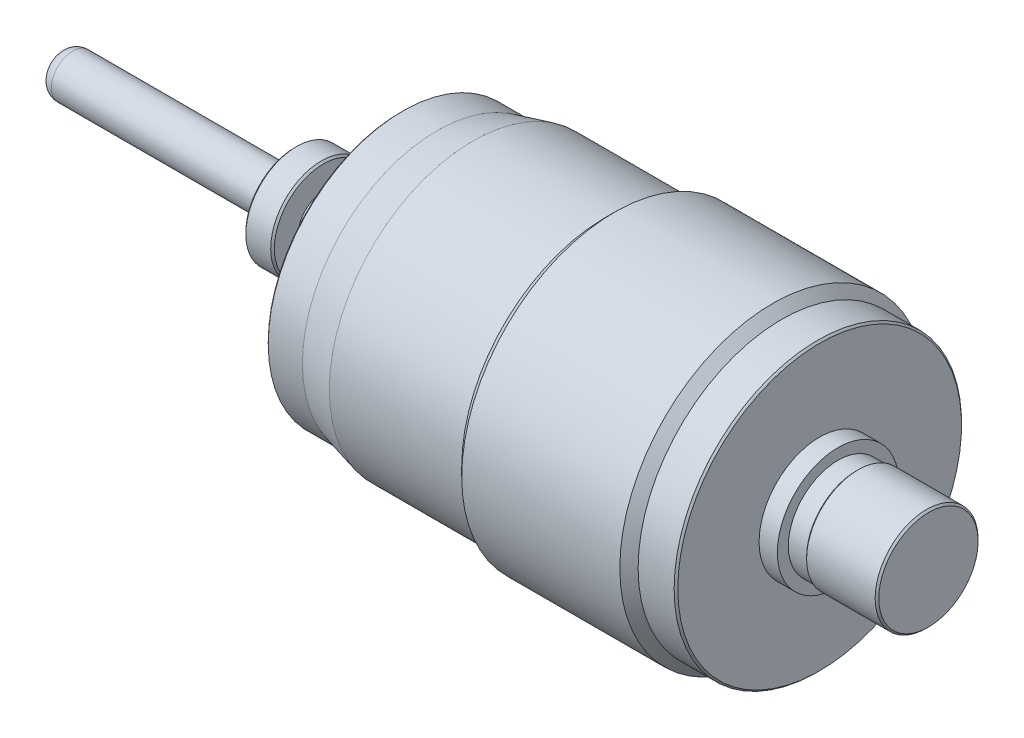
ISO-10303-21;
HEADER;
FILE_DESCRIPTION(('STEP AP214'),'2;1');
FILE_NAME('part.step','',(''),(''),'','','');
FILE_SCHEMA(('AUTOMOTIVE_DESIGN { 1 0 10303 214 1 1 1 1 }'));
ENDSEC;
DATA;
#1=APPLICATION_CONTEXT('core data for automotive mechanical design processes');
#2=APPLICATION_PROTOCOL_DEFINITION('international standard','automotive_design',2000,#1);
#3=PRODUCT_CONTEXT('',#1,'mechanical');
#4=PRODUCT('Part','Part','',(#3));
#5=PRODUCT_RELATED_PRODUCT_CATEGORY('part','',(#4));
#6=PRODUCT_DEFINITION_FORMATION('','',#4);
#7=PRODUCT_DEFINITION_CONTEXT('part definition',#1,'design');
#8=PRODUCT_DEFINITION('design','',#6,#7);
#9=PRODUCT_DEFINITION_SHAPE('','',#8);
#10=(LENGTH_UNIT() NAMED_UNIT(*) SI_UNIT(.MILLI.,.METRE.));
#11=(NAMED_UNIT(*) PLANE_ANGLE_UNIT() SI_UNIT($,.RADIAN.));
#12=(NAMED_UNIT(*) SI_UNIT($,.STERADIAN.) SOLID_ANGLE_UNIT());
#13=UNCERTAINTY_MEASURE_WITH_UNIT(LENGTH_MEASURE(1.E-05),#10,'distance_accuracy_value','');
#14=(GEOMETRIC_REPRESENTATION_CONTEXT(3) GLOBAL_UNCERTAINTY_ASSIGNED_CONTEXT((#13)) GLOBAL_UNIT_ASSIGNED_CONTEXT((#10,
#11,#12)) REPRESENTATION_CONTEXT('',''));
#15=CARTESIAN_POINT('',(0.,0.,0.));
#16=DIRECTION('',(0.,0.,1.));
#17=DIRECTION('',(1.,0.,0.));
#18=AXIS2_PLACEMENT_3D('',#15,#16,#17);
#19=CARTESIAN_POINT('',(-87.5488776201691,7.28712250712251,0.));
#20=DIRECTION('',(-1.,0.,0.));
#21=DIRECTION('',(0.,0.,1.));
#22=AXIS2_PLACEMENT_3D('',#19,#20,#21);
#23=CYLINDRICAL_SURFACE('',#22,2.9845);
#24=CARTESIAN_POINT('',(-52.2910740740741,7.28712250712251,0.));
#25=DIRECTION('',(-1.,0.,0.));
#26=DIRECTION('',(0.,0.,1.));
#27=AXIS2_PLACEMENT_3D('',#24,#25,#26);
#28=CIRCLE('',#27,2.9845);
#29=CARTESIAN_POINT('',(-52.2910740740741,7.28712250712251,2.9845));
#30=VERTEX_POINT('',#29);
#31=EDGE_CURVE('E11',#30,#30,#28,.T.);
#32=ORIENTED_EDGE('',*,*,#31,.F.);
#33=EDGE_LOOP('',(#32));
#34=FACE_BOUND('',#33,.T.);
#35=CARTESIAN_POINT('',(-21.4554740740741,7.28712250712251,0.));
#36=DIRECTION('',(-1.,0.,0.));
#37=DIRECTION('',(0.,0.,1.));
#38=AXIS2_PLACEMENT_3D('',#35,#36,#37);
#39=CIRCLE('',#38,2.9845);
#40=CARTESIAN_POINT('',(-21.4554740740741,7.28712250712251,2.9845));
#41=VERTEX_POINT('',#40);
#42=EDGE_CURVE('E155',#41,#41,#39,.T.);
#43=ORIENTED_EDGE('',*,*,#42,.T.);
#44=EDGE_LOOP('',(#43));
#45=FACE_BOUND('',#44,.T.);
#46=ADVANCED_FACE('F17',(#34,#45),#23,.T.);
#47=CARTESIAN_POINT('',(-52.2910740740741,7.28712250712251,0.));
#48=DIRECTION('',(-1.,0.,0.));
#49=DIRECTION('',(0.,0.,1.));
#50=AXIS2_PLACEMENT_3D('',#47,#48,#49);
#51=DEGENERATE_TOROIDAL_SURFACE('',#50,1.2065,1.778,.T.);
#52=CARTESIAN_POINT('',(-54.0690740740741,7.28712250712251,0.));
#53=DIRECTION('',(-1.,0.,0.));
#54=DIRECTION('',(0.,0.,1.));
#55=AXIS2_PLACEMENT_3D('',#52,#53,#54);
#56=CIRCLE('',#55,1.2065);
#57=CARTESIAN_POINT('',(-54.0690740740741,7.28712250712251,1.2065));
#58=VERTEX_POINT('',#57);
#59=EDGE_CURVE('E25',#58,#58,#56,.T.);
#60=ORIENTED_EDGE('',*,*,#59,.F.);
#61=EDGE_LOOP('',(#60));
#62=FACE_BOUND('',#61,.T.);
#63=ORIENTED_EDGE('',*,*,#31,.T.);
#64=EDGE_LOOP('',(#63));
#65=FACE_BOUND('',#64,.T.);
#66=ADVANCED_FACE('F189',(#62,#65),#51,.T.);
#67=CARTESIAN_POINT('',(-54.0690740740741,-77.5231416740364,0.));
#68=DIRECTION('',(1.,0.,0.));
#69=DIRECTION('',(0.,0.,-1.));
#70=AXIS2_PLACEMENT_3D('',#67,#68,#69);
#71=PLANE('',#70);
#72=ORIENTED_EDGE('',*,*,#59,.T.);
#73=EDGE_LOOP('',(#72));
#74=FACE_BOUND('',#73,.T.);
#75=ADVANCED_FACE('F194',(#74),#71,.F.);
#76=CARTESIAN_POINT('',(66.5809259259259,-77.5231416740365,0.));
#77=DIRECTION('',(1.,0.,0.));
#78=DIRECTION('',(0.,0.,-1.));
#79=AXIS2_PLACEMENT_3D('',#76,#77,#78);
#80=PLANE('',#79);
#81=CARTESIAN_POINT('',(66.5809259259259,7.28712250712251,0.));
#82=DIRECTION('',(-1.,0.,0.));
#83=DIRECTION('',(0.,0.,1.));
#84=AXIS2_PLACEMENT_3D('',#81,#82,#83);
#85=CIRCLE('',#84,6.8961);
#86=CARTESIAN_POINT('',(66.5809259259259,7.28712250712251,6.8961));
#87=VERTEX_POINT('',#86);
#88=EDGE_CURVE('E31',#87,#87,#85,.T.);
#89=ORIENTED_EDGE('',*,*,#88,.F.);
#90=EDGE_LOOP('',(#89));
#91=FACE_BOUND('',#90,.T.);
#92=ADVANCED_FACE('F390',(#91),#80,.T.);
#93=CARTESIAN_POINT('',(66.3269259259259,7.28712250712251,0.));
#94=DIRECTION('',(-1.,0.,0.));
#95=DIRECTION('',(0.,0.,1.));
#96=AXIS2_PLACEMENT_3D('',#93,#94,#95);
#97=CONICAL_SURFACE('',#96,7.1501,0.785398163397498);
#98=ORIENTED_EDGE('',*,*,#88,.T.);
#99=EDGE_LOOP('',(#98));
#100=FACE_BOUND('',#99,.T.);
#101=CARTESIAN_POINT('',(66.3269259259259,7.28712250712251,0.));
#102=DIRECTION('',(-1.,0.,0.));
#103=DIRECTION('',(0.,0.,1.));
#104=AXIS2_PLACEMENT_3D('',#101,#102,#103);
#105=CIRCLE('',#104,7.1501);
#106=CARTESIAN_POINT('',(66.3269259259259,7.28712250712251,7.1501));
#107=VERTEX_POINT('',#106);
#108=EDGE_CURVE('E36',#107,#107,#105,.T.);
#109=ORIENTED_EDGE('',*,*,#108,.F.);
#110=EDGE_LOOP('',(#109));
#111=FACE_BOUND('',#110,.T.);
#112=ADVANCED_FACE('F383',(#100,#111),#97,.T.);
#113=CARTESIAN_POINT('',(-87.5488776201691,7.28712250712251,0.));
#114=DIRECTION('',(-1.,0.,0.));
#115=DIRECTION('',(0.,0.,1.));
#116=AXIS2_PLACEMENT_3D('',#113,#114,#115);
#117=CYLINDRICAL_SURFACE('',#116,7.1501);
#118=ORIENTED_EDGE('',*,*,#108,.T.);
#119=EDGE_LOOP('',(#118));
#120=FACE_BOUND('',#119,.T.);
#121=CARTESIAN_POINT('',(56.8019259259259,7.28712250712251,0.));
#122=DIRECTION('',(-1.,0.,0.));
#123=DIRECTION('',(0.,0.,1.));
#124=AXIS2_PLACEMENT_3D('',#121,#122,#123);
#125=CIRCLE('',#124,7.1501);
#126=CARTESIAN_POINT('',(56.8019259259259,7.28712250712251,7.1501));
#127=VERTEX_POINT('',#126);
#128=EDGE_CURVE('E68',#127,#127,#125,.T.);
#129=ORIENTED_EDGE('',*,*,#128,.F.);
#130=EDGE_LOOP('',(#129));
#131=FACE_BOUND('',#130,.T.);
#132=ADVANCED_FACE('F376',(#120,#131),#117,.T.);
#133=CARTESIAN_POINT('',(56.5479259259259,7.28712250712251,0.));
#134=DIRECTION('',(1.,0.,0.));
#135=DIRECTION('',(0.,0.,-1.));
#136=AXIS2_PLACEMENT_3D('',#133,#134,#135);
#137=CONICAL_SURFACE('',#136,6.8961,0.785398163397448);
#138=ORIENTED_EDGE('',*,*,#128,.T.);
#139=EDGE_LOOP('',(#138));
#140=FACE_BOUND('',#139,.T.);
#141=CARTESIAN_POINT('',(56.5479259259259,7.28712250712251,0.));
#142=DIRECTION('',(-1.,0.,0.));
#143=DIRECTION('',(0.,0.,1.));
#144=AXIS2_PLACEMENT_3D('',#141,#142,#143);
#145=CIRCLE('',#144,6.8961);
#146=CARTESIAN_POINT('',(56.5479259259259,7.28712250712251,6.8961));
#147=VERTEX_POINT('',#146);
#148=EDGE_CURVE('E63',#147,#147,#145,.T.);
#149=ORIENTED_EDGE('',*,*,#148,.F.);
#150=EDGE_LOOP('',(#149));
#151=FACE_BOUND('',#150,.T.);
#152=ADVANCED_FACE('F369',(#140,#151),#137,.T.);
#153=CARTESIAN_POINT('',(-87.5488776201691,7.28712250712251,0.));
#154=DIRECTION('',(-1.,0.,0.));
#155=DIRECTION('',(0.,0.,1.));
#156=AXIS2_PLACEMENT_3D('',#153,#154,#155);
#157=CYLINDRICAL_SURFACE('',#156,6.8961);
#158=ORIENTED_EDGE('',*,*,#148,.T.);
#159=EDGE_LOOP('',(#158));
#160=FACE_BOUND('',#159,.T.);
#161=CARTESIAN_POINT('',(54.0079259259259,7.28712250712251,0.));
#162=DIRECTION('',(-1.,0.,0.));
#163=DIRECTION('',(0.,0.,1.));
#164=AXIS2_PLACEMENT_3D('',#161,#162,#163);
#165=CIRCLE('',#164,6.8961);
#166=CARTESIAN_POINT('',(54.0079259259259,7.28712250712251,6.8961));
#167=VERTEX_POINT('',#166);
#168=EDGE_CURVE('E55',#167,#167,#165,.T.);
#169=ORIENTED_EDGE('',*,*,#168,.F.);
#170=EDGE_LOOP('',(#169));
#171=FACE_BOUND('',#170,.T.);
#172=ADVANCED_FACE('F362',(#160,#171),#157,.T.);
#173=CARTESIAN_POINT('',(54.0079259259259,-77.5231416740364,0.));
#174=DIRECTION('',(1.,0.,0.));
#175=DIRECTION('',(0.,0.,-1.));
#176=AXIS2_PLACEMENT_3D('',#173,#174,#175);
#177=PLANE('',#176);
#178=ORIENTED_EDGE('',*,*,#168,.T.);
#179=EDGE_LOOP('',(#178));
#180=FACE_BOUND('',#179,.T.);
#181=CARTESIAN_POINT('',(54.0079259259259,7.28712250712251,0.));
#182=DIRECTION('',(-1.,0.,0.));
#183=DIRECTION('',(0.,0.,1.));
#184=AXIS2_PLACEMENT_3D('',#181,#182,#183);
#185=CIRCLE('',#184,8.4201);
#186=CARTESIAN_POINT('',(54.0079259259259,7.28712250712251,8.4201));
#187=VERTEX_POINT('',#186);
#188=EDGE_CURVE('E50',#187,#187,#185,.T.);
#189=ORIENTED_EDGE('',*,*,#188,.F.);
#190=EDGE_LOOP('',(#189));
#191=FACE_BOUND('',#190,.T.);
#192=ADVANCED_FACE('F355',(#180,#191),#177,.T.);
#193=CARTESIAN_POINT('',(-87.5488776201691,7.28712250712251,0.));
#194=DIRECTION('',(-1.,0.,0.));
#195=DIRECTION('',(0.,0.,1.));
#196=AXIS2_PLACEMENT_3D('',#193,#194,#195);
#197=CYLINDRICAL_SURFACE('',#196,8.4201);
#198=ORIENTED_EDGE('',*,*,#188,.T.);
#199=EDGE_LOOP('',(#198));
#200=FACE_BOUND('',#199,.T.);
#201=CARTESIAN_POINT('',(51.4679259259259,7.28712250712251,0.));
#202=DIRECTION('',(-1.,0.,0.));
#203=DIRECTION('',(0.,0.,1.));
#204=AXIS2_PLACEMENT_3D('',#201,#202,#203);
#205=CIRCLE('',#204,8.4201);
#206=CARTESIAN_POINT('',(51.4679259259259,7.28712250712251,8.4201));
#207=VERTEX_POINT('',#206);
#208=EDGE_CURVE('E56',#207,#207,#205,.T.);
#209=ORIENTED_EDGE('',*,*,#208,.F.);
#210=EDGE_LOOP('',(#209));
#211=FACE_BOUND('',#210,.T.);
#212=ADVANCED_FACE('F348',(#200,#211),#197,.T.);
#213=CARTESIAN_POINT('',(51.4679259259259,-77.5231416740364,0.));
#214=DIRECTION('',(1.,0.,0.));
#215=DIRECTION('',(0.,0.,-1.));
#216=AXIS2_PLACEMENT_3D('',#213,#214,#215);
#217=PLANE('',#216);
#218=ORIENTED_EDGE('',*,*,#208,.T.);
#219=EDGE_LOOP('',(#218));
#220=FACE_BOUND('',#219,.T.);
#221=CARTESIAN_POINT('',(51.4679259259259,7.28712250712251,0.));
#222=DIRECTION('',(-1.,0.,0.));
#223=DIRECTION('',(0.,0.,1.));
#224=AXIS2_PLACEMENT_3D('',#221,#222,#223);
#225=CIRCLE('',#224,19.7104);
#226=CARTESIAN_POINT('',(51.4679259259259,7.28712250712251,19.7104));
#227=VERTEX_POINT('',#226);
#228=EDGE_CURVE('E76',#227,#227,#225,.T.);
#229=ORIENTED_EDGE('',*,*,#228,.F.);
#230=EDGE_LOOP('',(#229));
#231=FACE_BOUND('',#230,.T.);
#232=ADVANCED_FACE('F341',(#220,#231),#217,.T.);
#233=CARTESIAN_POINT('',(51.2139259259259,7.28712250712251,0.));
#234=DIRECTION('',(-1.,0.,0.));
#235=DIRECTION('',(0.,0.,1.));
#236=AXIS2_PLACEMENT_3D('',#233,#234,#235);
#237=CONICAL_SURFACE('',#236,19.9644,0.785398163397503);
#238=ORIENTED_EDGE('',*,*,#228,.T.);
#239=EDGE_LOOP('',(#238));
#240=FACE_BOUND('',#239,.T.);
#241=CARTESIAN_POINT('',(51.2139259259259,7.28712250712251,0.));
#242=DIRECTION('',(-1.,0.,0.));
#243=DIRECTION('',(0.,0.,1.));
#244=AXIS2_PLACEMENT_3D('',#241,#242,#243);
#245=CIRCLE('',#244,19.9644);
#246=CARTESIAN_POINT('',(51.2139259259259,7.28712250712251,19.9644));
#247=VERTEX_POINT('',#246);
#248=EDGE_CURVE('E81',#247,#247,#245,.T.);
#249=ORIENTED_EDGE('',*,*,#248,.F.);
#250=EDGE_LOOP('',(#249));
#251=FACE_BOUND('',#250,.T.);
#252=ADVANCED_FACE('F334',(#240,#251),#237,.T.);
#253=CARTESIAN_POINT('',(-87.5488776201691,7.28712250712251,0.));
#254=DIRECTION('',(-1.,0.,0.));
#255=DIRECTION('',(0.,0.,1.));
#256=AXIS2_PLACEMENT_3D('',#253,#254,#255);
#257=CYLINDRICAL_SURFACE('',#256,19.9644);
#258=ORIENTED_EDGE('',*,*,#248,.T.);
#259=EDGE_LOOP('',(#258));
#260=FACE_BOUND('',#259,.T.);
#261=CARTESIAN_POINT('',(46.2101259259259,7.28712250712251,0.));
#262=DIRECTION('',(-1.,0.,0.));
#263=DIRECTION('',(0.,0.,1.));
#264=AXIS2_PLACEMENT_3D('',#261,#262,#263);
#265=CIRCLE('',#264,19.9644);
#266=CARTESIAN_POINT('',(46.2101259259259,7.28712250712251,19.9644));
#267=VERTEX_POINT('',#266);
#268=EDGE_CURVE('E85',#267,#267,#265,.T.);
#269=ORIENTED_EDGE('',*,*,#268,.F.);
#270=EDGE_LOOP('',(#269));
#271=FACE_BOUND('',#270,.T.);
#272=ADVANCED_FACE('F327',(#260,#271),#257,.T.);
#273=CARTESIAN_POINT('',(44.940125925926,7.28712250712251,0.));
#274=DIRECTION('',(-1.,0.,0.));
#275=DIRECTION('',(0.,0.,1.));
#276=AXIS2_PLACEMENT_3D('',#273,#274,#275);
#277=CONICAL_SURFACE('',#276,21.2344,0.785398163397453);
#278=ORIENTED_EDGE('',*,*,#268,.T.);
#279=EDGE_LOOP('',(#278));
#280=FACE_BOUND('',#279,.T.);
#281=CARTESIAN_POINT('',(44.940125925926,7.28712250712251,0.));
#282=DIRECTION('',(-1.,0.,0.));
#283=DIRECTION('',(0.,0.,1.));
#284=AXIS2_PLACEMENT_3D('',#281,#282,#283);
#285=CIRCLE('',#284,21.2344);
#286=CARTESIAN_POINT('',(44.940125925926,7.28712250712251,21.2344));
#287=VERTEX_POINT('',#286);
#288=EDGE_CURVE('E95',#287,#287,#285,.T.);
#289=ORIENTED_EDGE('',*,*,#288,.F.);
#290=EDGE_LOOP('',(#289));
#291=FACE_BOUND('',#290,.T.);
#292=ADVANCED_FACE('F320',(#280,#291),#277,.T.);
#293=CARTESIAN_POINT('',(-87.5488776201691,7.28712250712251,0.));
#294=DIRECTION('',(-1.,0.,0.));
#295=DIRECTION('',(0.,0.,1.));
#296=AXIS2_PLACEMENT_3D('',#293,#294,#295);
#297=CYLINDRICAL_SURFACE('',#296,21.2344);
#298=ORIENTED_EDGE('',*,*,#288,.T.);
#299=EDGE_LOOP('',(#298));
#300=FACE_BOUND('',#299,.T.);
#301=CARTESIAN_POINT('',(22.9765231912497,7.28712250712251,0.));
#302=DIRECTION('',(-1.,0.,0.));
#303=DIRECTION('',(0.,0.,1.));
#304=AXIS2_PLACEMENT_3D('',#301,#302,#303);
#305=CIRCLE('',#304,21.2344);
#306=CARTESIAN_POINT('',(22.9765231912497,7.28712250712251,21.2344));
#307=VERTEX_POINT('',#306);
#308=EDGE_CURVE('E99',#307,#307,#305,.T.);
#309=ORIENTED_EDGE('',*,*,#308,.F.);
#310=EDGE_LOOP('',(#309));
#311=FACE_BOUND('',#310,.T.);
#312=ADVANCED_FACE('F313',(#300,#311),#297,.T.);
#313=CARTESIAN_POINT('',(21.7065231912497,7.28712250712251,0.));
#314=DIRECTION('',(1.,0.,0.));
#315=DIRECTION('',(0.,0.,-1.));
#316=AXIS2_PLACEMENT_3D('',#313,#314,#315);
#317=CONICAL_SURFACE('',#316,19.9644,0.785398163397441);
#318=ORIENTED_EDGE('',*,*,#308,.T.);
#319=EDGE_LOOP('',(#318));
#320=FACE_BOUND('',#319,.T.);
#321=CARTESIAN_POINT('',(21.7065231912497,7.28712250712251,0.));
#322=DIRECTION('',(-1.,0.,0.));
#323=DIRECTION('',(0.,0.,1.));
#324=AXIS2_PLACEMENT_3D('',#321,#322,#323);
#325=CIRCLE('',#324,19.9644);
#326=CARTESIAN_POINT('',(21.7065231912497,7.28712250712251,19.9644));
#327=VERTEX_POINT('',#326);
#328=EDGE_CURVE('E104',#327,#327,#325,.T.);
#329=ORIENTED_EDGE('',*,*,#328,.F.);
#330=EDGE_LOOP('',(#329));
#331=FACE_BOUND('',#330,.T.);
#332=ADVANCED_FACE('F306',(#320,#331),#317,.T.);
#333=CARTESIAN_POINT('',(-87.5488776201691,7.28712250712251,0.));
#334=DIRECTION('',(-1.,0.,0.));
#335=DIRECTION('',(0.,0.,1.));
#336=AXIS2_PLACEMENT_3D('',#333,#334,#335);
#337=CYLINDRICAL_SURFACE('',#336,19.9644);
#338=ORIENTED_EDGE('',*,*,#328,.T.);
#339=EDGE_LOOP('',(#338));
#340=FACE_BOUND('',#339,.T.);
#341=CARTESIAN_POINT('',(3.30952592592592,7.28712250712251,0.));
#342=DIRECTION('',(-1.,0.,0.));
#343=DIRECTION('',(0.,0.,1.));
#344=AXIS2_PLACEMENT_3D('',#341,#342,#343);
#345=CIRCLE('',#344,19.9644);
#346=CARTESIAN_POINT('',(3.30952592592592,7.28712250712251,19.9644));
#347=VERTEX_POINT('',#346);
#348=EDGE_CURVE('E109',#347,#347,#345,.T.);
#349=ORIENTED_EDGE('',*,*,#348,.F.);
#350=EDGE_LOOP('',(#349));
#351=FACE_BOUND('',#350,.T.);
#352=ADVANCED_FACE('F299',(#340,#351),#337,.T.);
#353=CARTESIAN_POINT('',(-1.69427407407409,7.28712250712251,0.));
#354=DIRECTION('',(1.,0.,0.));
#355=DIRECTION('',(0.,0.,-1.));
#356=AXIS2_PLACEMENT_3D('',#353,#354,#355);
#357=CONICAL_SURFACE('',#356,18.6944,0.248558600100656);
#358=ORIENTED_EDGE('',*,*,#348,.T.);
#359=EDGE_LOOP('',(#358));
#360=FACE_BOUND('',#359,.T.);
#361=CARTESIAN_POINT('',(-1.69427407407409,7.28712250712251,0.));
#362=DIRECTION('',(-1.,0.,0.));
#363=DIRECTION('',(0.,0.,1.));
#364=AXIS2_PLACEMENT_3D('',#361,#362,#363);
#365=CIRCLE('',#364,18.6944);
#366=CARTESIAN_POINT('',(-1.69427407407409,7.28712250712251,18.6944));
#367=VERTEX_POINT('',#366);
#368=EDGE_CURVE('E115',#367,#367,#365,.T.);
#369=ORIENTED_EDGE('',*,*,#368,.F.);
#370=EDGE_LOOP('',(#369));
#371=FACE_BOUND('',#370,.T.);
#372=ADVANCED_FACE('F292',(#360,#371),#357,.T.);
#373=CARTESIAN_POINT('',(-87.5488776201691,7.28712250712251,0.));
#374=DIRECTION('',(-1.,0.,0.));
#375=DIRECTION('',(0.,0.,1.));
#376=AXIS2_PLACEMENT_3D('',#373,#374,#375);
#377=CYLINDRICAL_SURFACE('',#376,18.6944);
#378=CARTESIAN_POINT('',(-6.44407407407408,7.28712250712251,0.));
#379=DIRECTION('',(-1.,0.,0.));
#380=DIRECTION('',(0.,0.,1.));
#381=AXIS2_PLACEMENT_3D('',#378,#379,#380);
#382=CIRCLE('',#381,18.6944);
#383=CARTESIAN_POINT('',(-6.44407407407408,7.28712250712251,18.6944));
#384=VERTEX_POINT('',#383);
#385=EDGE_CURVE('E120',#384,#384,#382,.T.);
#386=ORIENTED_EDGE('',*,*,#385,.F.);
#387=EDGE_LOOP('',(#386));
#388=FACE_BOUND('',#387,.T.);
#389=ORIENTED_EDGE('',*,*,#368,.T.);
#390=EDGE_LOOP('',(#389));
#391=FACE_BOUND('',#390,.T.);
#392=ADVANCED_FACE('F285',(#388,#391),#377,.T.);
#393=CARTESIAN_POINT('',(-6.69807407407407,7.28712250712251,0.));
#394=DIRECTION('',(1.,0.,0.));
#395=DIRECTION('',(0.,0.,-1.));
#396=AXIS2_PLACEMENT_3D('',#393,#394,#395);
#397=CONICAL_SURFACE('',#396,18.4404,0.785398163397476);
#398=ORIENTED_EDGE('',*,*,#385,.T.);
#399=EDGE_LOOP('',(#398));
#400=FACE_BOUND('',#399,.T.);
#401=CARTESIAN_POINT('',(-6.69807407407407,7.28712250712251,0.));
#402=DIRECTION('',(-1.,0.,0.));
#403=DIRECTION('',(0.,0.,1.));
#404=AXIS2_PLACEMENT_3D('',#401,#402,#403);
#405=CIRCLE('',#404,18.4404);
#406=CARTESIAN_POINT('',(-6.69807407407407,7.28712250712251,18.4404));
#407=VERTEX_POINT('',#406);
#408=EDGE_CURVE('E124',#407,#407,#405,.T.);
#409=ORIENTED_EDGE('',*,*,#408,.F.);
#410=EDGE_LOOP('',(#409));
#411=FACE_BOUND('',#410,.T.);
#412=ADVANCED_FACE('F278',(#400,#411),#397,.T.);
#413=CARTESIAN_POINT('',(-6.69807407407408,-77.5231416740364,0.));
#414=DIRECTION('',(-1.,0.,0.));
#415=DIRECTION('',(0.,0.,1.));
#416=AXIS2_PLACEMENT_3D('',#413,#414,#415);
#417=PLANE('',#416);
#418=ORIENTED_EDGE('',*,*,#408,.T.);
#419=EDGE_LOOP('',(#418));
#420=FACE_BOUND('',#419,.T.);
#421=CARTESIAN_POINT('',(-6.69807407407407,7.28712250712251,0.));
#422=DIRECTION('',(-1.,0.,0.));
#423=DIRECTION('',(0.,0.,1.));
#424=AXIS2_PLACEMENT_3D('',#421,#422,#423);
#425=CIRCLE('',#424,3.5052);
#426=CARTESIAN_POINT('',(-6.69807407407407,7.28712250712251,3.5052));
#427=VERTEX_POINT('',#426);
#428=EDGE_CURVE('E572',#427,#427,#425,.T.);
#429=ORIENTED_EDGE('',*,*,#428,.F.);
#430=EDGE_LOOP('',(#429));
#431=FACE_BOUND('',#430,.T.);
#432=ADVANCED_FACE('F270',(#420,#431),#417,.T.);
#433=CARTESIAN_POINT('',(-87.5488776201691,7.28712250712251,0.));
#434=DIRECTION('',(-1.,0.,0.));
#435=DIRECTION('',(0.,0.,1.));
#436=AXIS2_PLACEMENT_3D('',#433,#434,#435);
#437=CYLINDRICAL_SURFACE('',#436,3.5052);
#438=ORIENTED_EDGE('',*,*,#428,.T.);
#439=EDGE_LOOP('',(#438));
#440=FACE_BOUND('',#439,.T.);
#441=CARTESIAN_POINT('',(-7.96807407407408,7.28712250712251,0.));
#442=DIRECTION('',(-1.,0.,0.));
#443=DIRECTION('',(0.,0.,1.));
#444=AXIS2_PLACEMENT_3D('',#441,#442,#443);
#445=CIRCLE('',#444,3.5052);
#446=CARTESIAN_POINT('',(-7.96807407407408,7.28712250712251,3.5052));
#447=VERTEX_POINT('',#446);
#448=EDGE_CURVE('E575',#447,#447,#445,.T.);
#449=ORIENTED_EDGE('',*,*,#448,.F.);
#450=EDGE_LOOP('',(#449));
#451=FACE_BOUND('',#450,.T.);
#452=ADVANCED_FACE('F262',(#440,#451),#437,.T.);
#453=CARTESIAN_POINT('',(-7.96807407407408,-77.5231416740364,0.));
#454=DIRECTION('',(1.,0.,0.));
#455=DIRECTION('',(0.,0.,-1.));
#456=AXIS2_PLACEMENT_3D('',#453,#454,#455);
#457=PLANE('',#456);
#458=ORIENTED_EDGE('',*,*,#448,.T.);
#459=EDGE_LOOP('',(#458));
#460=FACE_BOUND('',#459,.T.);
#461=CARTESIAN_POINT('',(-7.96807407407408,7.28712250712251,0.));
#462=DIRECTION('',(-1.,0.,0.));
#463=DIRECTION('',(0.,0.,1.));
#464=AXIS2_PLACEMENT_3D('',#461,#462,#463);
#465=CIRCLE('',#464,4.7625);
#466=CARTESIAN_POINT('',(-7.96807407407408,7.28712250712251,4.7625));
#467=VERTEX_POINT('',#466);
#468=EDGE_CURVE('E578',#467,#467,#465,.T.);
#469=ORIENTED_EDGE('',*,*,#468,.F.);
#470=EDGE_LOOP('',(#469));
#471=FACE_BOUND('',#470,.T.);
#472=ADVANCED_FACE('F254',(#460,#471),#457,.T.);
#473=CARTESIAN_POINT('',(-87.5488776201691,7.28712250712251,0.));
#474=DIRECTION('',(-1.,0.,0.));
#475=DIRECTION('',(0.,0.,1.));
#476=AXIS2_PLACEMENT_3D('',#473,#474,#475);
#477=CYLINDRICAL_SURFACE('',#476,4.7625);
#478=ORIENTED_EDGE('',*,*,#468,.T.);
#479=EDGE_LOOP('',(#478));
#480=FACE_BOUND('',#479,.T.);
#481=CARTESIAN_POINT('',(-16.2230740740741,7.28712250712251,0.));
#482=DIRECTION('',(-1.,0.,0.));
#483=DIRECTION('',(0.,0.,1.));
#484=AXIS2_PLACEMENT_3D('',#481,#482,#483);
#485=CIRCLE('',#484,4.7625);
#486=CARTESIAN_POINT('',(-16.2230740740741,7.28712250712251,4.7625));
#487=VERTEX_POINT('',#486);
#488=EDGE_CURVE('E582',#487,#487,#485,.T.);
#489=ORIENTED_EDGE('',*,*,#488,.F.);
#490=EDGE_LOOP('',(#489));
#491=FACE_BOUND('',#490,.T.);
#492=ADVANCED_FACE('F245',(#480,#491),#477,.T.);
#493=CARTESIAN_POINT('',(-16.2230740740741,-77.5231416740364,0.));
#494=DIRECTION('',(1.,0.,0.));
#495=DIRECTION('',(0.,0.,-1.));
#496=AXIS2_PLACEMENT_3D('',#493,#494,#495);
#497=PLANE('',#496);
#498=CARTESIAN_POINT('',(-16.2230740740741,7.28712250712251,0.));
#499=DIRECTION('',(-1.,0.,0.));
#500=DIRECTION('',(0.,0.,1.));
#501=AXIS2_PLACEMENT_3D('',#498,#499,#500);
#502=CIRCLE('',#501,3.4925);
#503=CARTESIAN_POINT('',(-16.2230740740741,7.28712250712251,3.4925));
#504=VERTEX_POINT('',#503);
#505=EDGE_CURVE('E146',#504,#504,#502,.T.);
#506=ORIENTED_EDGE('',*,*,#505,.F.);
#507=EDGE_LOOP('',(#506));
#508=FACE_BOUND('',#507,.T.);
#509=ORIENTED_EDGE('',*,*,#488,.T.);
#510=EDGE_LOOP('',(#509));
#511=FACE_BOUND('',#510,.T.);
#512=ADVANCED_FACE('F235',(#508,#511),#497,.F.);
#513=CARTESIAN_POINT('',(-87.5488776201691,7.28712250712251,0.));
#514=DIRECTION('',(-1.,0.,0.));
#515=DIRECTION('',(0.,0.,1.));
#516=AXIS2_PLACEMENT_3D('',#513,#514,#515);
#517=CYLINDRICAL_SURFACE('',#516,3.4925);
#518=CARTESIAN_POINT('',(-17.493074074074,7.28712250712251,0.));
#519=DIRECTION('',(-1.,0.,0.));
#520=DIRECTION('',(0.,0.,1.));
#521=AXIS2_PLACEMENT_3D('',#518,#519,#520);
#522=CIRCLE('',#521,3.4925);
#523=CARTESIAN_POINT('',(-17.493074074074,7.28712250712251,3.4925));
#524=VERTEX_POINT('',#523);
#525=EDGE_CURVE('E141',#524,#524,#522,.T.);
#526=ORIENTED_EDGE('',*,*,#525,.F.);
#527=EDGE_LOOP('',(#526));
#528=FACE_BOUND('',#527,.T.);
#529=ORIENTED_EDGE('',*,*,#505,.T.);
#530=EDGE_LOOP('',(#529));
#531=FACE_BOUND('',#530,.T.);
#532=ADVANCED_FACE('F225',(#528,#531),#517,.T.);
#533=CARTESIAN_POINT('',(-17.493074074074,-77.5231416740364,0.));
#534=DIRECTION('',(1.,0.,0.));
#535=DIRECTION('',(0.,0.,-1.));
#536=AXIS2_PLACEMENT_3D('',#533,#534,#535);
#537=PLANE('',#536);
#538=ORIENTED_EDGE('',*,*,#525,.T.);
#539=EDGE_LOOP('',(#538));
#540=FACE_BOUND('',#539,.T.);
#541=CARTESIAN_POINT('',(-17.493074074074,7.28712250712251,0.));
#542=DIRECTION('',(-1.,0.,0.));
#543=DIRECTION('',(0.,0.,1.));
#544=AXIS2_PLACEMENT_3D('',#541,#542,#543);
#545=CIRCLE('',#544,6.7945);
#546=CARTESIAN_POINT('',(-17.493074074074,7.28712250712251,6.7945));
#547=VERTEX_POINT('',#546);
#548=EDGE_CURVE('E134',#547,#547,#545,.T.);
#549=ORIENTED_EDGE('',*,*,#548,.F.);
#550=EDGE_LOOP('',(#549));
#551=FACE_BOUND('',#550,.T.);
#552=ADVANCED_FACE('F185',(#540,#551),#537,.T.);
#553=CARTESIAN_POINT('',(-17.7470740740741,7.28712250712251,0.));
#554=DIRECTION('',(-1.,0.,0.));
#555=DIRECTION('',(0.,0.,1.));
#556=AXIS2_PLACEMENT_3D('',#553,#554,#555);
#557=CONICAL_SURFACE('',#556,7.0485,0.785398163397421);
#558=ORIENTED_EDGE('',*,*,#548,.T.);
#559=EDGE_LOOP('',(#558));
#560=FACE_BOUND('',#559,.T.);
#561=CARTESIAN_POINT('',(-17.7470740740741,7.28712250712251,0.));
#562=DIRECTION('',(-1.,0.,0.));
#563=DIRECTION('',(0.,0.,1.));
#564=AXIS2_PLACEMENT_3D('',#561,#562,#563);
#565=CIRCLE('',#564,7.0485);
#566=CARTESIAN_POINT('',(-17.7470740740741,7.28712250712251,7.0485));
#567=VERTEX_POINT('',#566);
#568=EDGE_CURVE('E129',#567,#567,#565,.T.);
#569=ORIENTED_EDGE('',*,*,#568,.F.);
#570=EDGE_LOOP('',(#569));
#571=FACE_BOUND('',#570,.T.);
#572=ADVANCED_FACE('F174',(#560,#571),#557,.T.);
#573=CARTESIAN_POINT('',(-87.5488776201691,7.28712250712251,0.));
#574=DIRECTION('',(-1.,0.,0.));
#575=DIRECTION('',(0.,0.,1.));
#576=AXIS2_PLACEMENT_3D('',#573,#574,#575);
#577=CYLINDRICAL_SURFACE('',#576,7.0485);
#578=ORIENTED_EDGE('',*,*,#568,.T.);
#579=EDGE_LOOP('',(#578));
#580=FACE_BOUND('',#579,.T.);
#581=CARTESIAN_POINT('',(-21.201474074074,7.28712250712251,0.));
#582=DIRECTION('',(-1.,0.,0.));
#583=DIRECTION('',(0.,0.,1.));
#584=AXIS2_PLACEMENT_3D('',#581,#582,#583);
#585=CIRCLE('',#584,7.0485);
#586=CARTESIAN_POINT('',(-21.201474074074,7.28712250712251,7.0485));
#587=VERTEX_POINT('',#586);
#588=EDGE_CURVE('E135',#587,#587,#585,.T.);
#589=ORIENTED_EDGE('',*,*,#588,.F.);
#590=EDGE_LOOP('',(#589));
#591=FACE_BOUND('',#590,.T.);
#592=ADVANCED_FACE('F172',(#580,#591),#577,.T.);
#593=CARTESIAN_POINT('',(-21.4554740740741,7.28712250712251,0.));
#594=DIRECTION('',(1.,0.,0.));
#595=DIRECTION('',(0.,0.,-1.));
#596=AXIS2_PLACEMENT_3D('',#593,#594,#595);
#597=CONICAL_SURFACE('',#596,6.7945,0.785398163397435);
#598=ORIENTED_EDGE('',*,*,#588,.T.);
#599=EDGE_LOOP('',(#598));
#600=FACE_BOUND('',#599,.T.);
#601=CARTESIAN_POINT('',(-21.4554740740741,7.28712250712251,0.));
#602=DIRECTION('',(-1.,0.,0.));
#603=DIRECTION('',(0.,0.,1.));
#604=AXIS2_PLACEMENT_3D('',#601,#602,#603);
#605=CIRCLE('',#604,6.7945);
#606=CARTESIAN_POINT('',(-21.4554740740741,7.28712250712251,6.7945));
#607=VERTEX_POINT('',#606);
#608=EDGE_CURVE('E159',#607,#607,#605,.T.);
#609=ORIENTED_EDGE('',*,*,#608,.F.);
#610=EDGE_LOOP('',(#609));
#611=FACE_BOUND('',#610,.T.);
#612=ADVANCED_FACE('F169',(#600,#611),#597,.T.);
#613=CARTESIAN_POINT('',(-21.4554740740741,-77.5231416740364,0.));
#614=DIRECTION('',(1.,0.,0.));
#615=DIRECTION('',(0.,0.,-1.));
#616=AXIS2_PLACEMENT_3D('',#613,#614,#615);
#617=PLANE('',#616);
#618=ORIENTED_EDGE('',*,*,#42,.F.);
#619=EDGE_LOOP('',(#618));
#620=FACE_BOUND('',#619,.T.);
#621=ORIENTED_EDGE('',*,*,#608,.T.);
#622=EDGE_LOOP('',(#621));
#623=FACE_BOUND('',#622,.T.);
#624=ADVANCED_FACE('F183',(#620,#623),#617,.F.);
#625=CLOSED_SHELL('',(#46,#66,#75,#92,#112,#132,#152,#172,#192,#212,#232,#252,#272,#292,#312,
#332,#352,#372,#392,#412,#432,#452,#472,#492,#512,#532,#552,#572,#592,#612,#624));
#626=MANIFOLD_SOLID_BREP('B1',#625);
#627=ADVANCED_BREP_SHAPE_REPRESENTATION('',(#18,#626),#14);
#628=SHAPE_DEFINITION_REPRESENTATION(#9,#627);
ENDSEC;
END-ISO-10303-21;
